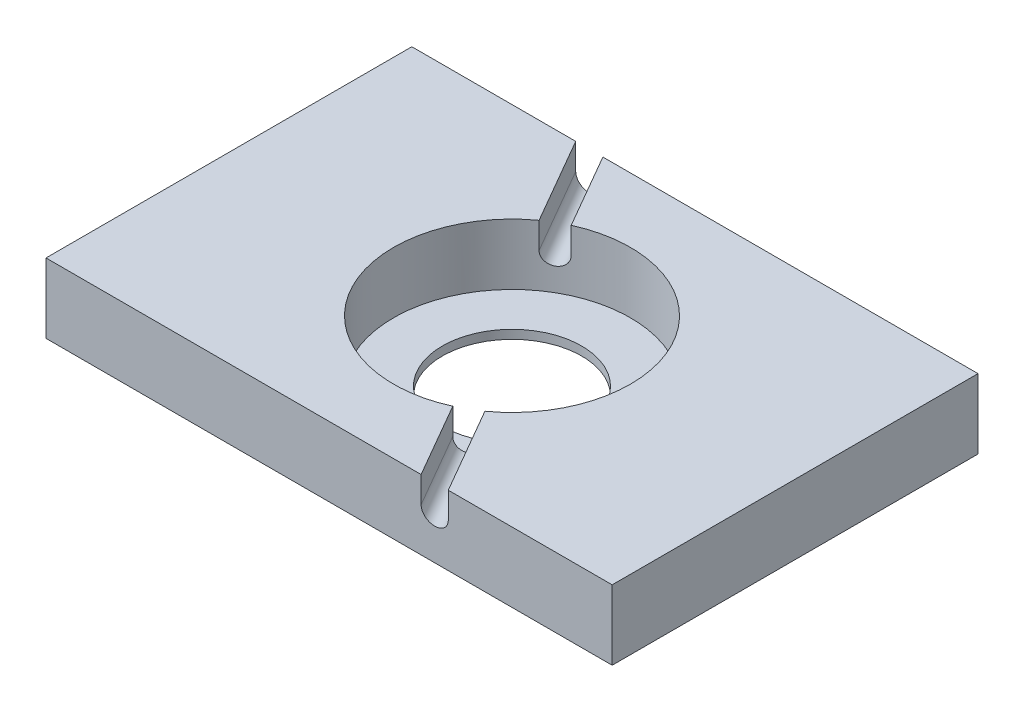
ISO-10303-21;
HEADER;
FILE_DESCRIPTION(('STEP AP214'),'2;1');
FILE_NAME('part.step','',(''),(''),'','','');
FILE_SCHEMA(('AUTOMOTIVE_DESIGN { 1 0 10303 214 1 1 1 1 }'));
ENDSEC;
DATA;
#1=APPLICATION_CONTEXT('core data for automotive mechanical design processes');
#2=APPLICATION_PROTOCOL_DEFINITION('international standard','automotive_design',2000,#1);
#3=PRODUCT_CONTEXT('',#1,'mechanical');
#4=PRODUCT('Part','Part','',(#3));
#5=PRODUCT_RELATED_PRODUCT_CATEGORY('part','',(#4));
#6=PRODUCT_DEFINITION_FORMATION('','',#4);
#7=PRODUCT_DEFINITION_CONTEXT('part definition',#1,'design');
#8=PRODUCT_DEFINITION('design','',#6,#7);
#9=PRODUCT_DEFINITION_SHAPE('','',#8);
#10=(LENGTH_UNIT() NAMED_UNIT(*) SI_UNIT(.MILLI.,.METRE.));
#11=(NAMED_UNIT(*) PLANE_ANGLE_UNIT() SI_UNIT($,.RADIAN.));
#12=(NAMED_UNIT(*) SI_UNIT($,.STERADIAN.) SOLID_ANGLE_UNIT());
#13=UNCERTAINTY_MEASURE_WITH_UNIT(LENGTH_MEASURE(1.E-05),#10,'distance_accuracy_value','');
#14=(GEOMETRIC_REPRESENTATION_CONTEXT(3) GLOBAL_UNCERTAINTY_ASSIGNED_CONTEXT((#13)) GLOBAL_UNIT_ASSIGNED_CONTEXT((#10,
#11,#12)) REPRESENTATION_CONTEXT('',''));
#15=CARTESIAN_POINT('',(0.,0.,0.));
#16=DIRECTION('',(0.,0.,1.));
#17=DIRECTION('',(1.,0.,0.));
#18=AXIS2_PLACEMENT_3D('',#15,#16,#17);
#19=CARTESIAN_POINT('',(0.,5.,0.));
#20=DIRECTION('',(-0.500000000000001,0.,-0.866025403784438));
#21=DIRECTION('',(-0.866025403784438,0.,0.500000000000001));
#22=AXIS2_PLACEMENT_3D('',#19,#20,#21);
#23=CYLINDRICAL_SURFACE('',#22,1.35);
#24=DIRECTION('',(0.500000000000001,0.,0.866025403784438));
#25=VECTOR('',#24,1.);
#26=CARTESIAN_POINT('',(-1.16913429510899,5.,0.674999999999999));
#27=LINE('',#26,#25);
#28=CARTESIAN_POINT('',(5.59728093010444,5.,12.3947749551772));
#29=VERTEX_POINT('',#28);
#30=CARTESIAN_POINT('',(10.5655099261702,5.,21.));
#31=VERTEX_POINT('',#30);
#32=EDGE_CURVE('E161',#29,#31,#27,.T.);
#33=ORIENTED_EDGE('',*,*,#32,.T.);
#34=CARTESIAN_POINT('',(12.1243556529822,5.,21.));
#35=DIRECTION('',(0.,0.,1.));
#36=DIRECTION('',(-1.,0.,0.));
#37=AXIS2_PLACEMENT_3D('',#34,#35,#36);
#38=ELLIPSE('',#37,1.55884572681199,1.35);
#39=CARTESIAN_POINT('',(13.6832013797942,5.,21.));
#40=VERTEX_POINT('',#39);
#41=EDGE_CURVE('E155',#31,#40,#38,.T.);
#42=ORIENTED_EDGE('',*,*,#41,.T.);
#43=DIRECTION('',(0.500000000000001,0.,0.866025403784438));
#44=VECTOR('',#43,1.);
#45=CARTESIAN_POINT('',(1.16913429510899,5.,-0.675000000000003));
#46=LINE('',#45,#44);
#47=CARTESIAN_POINT('',(7.93554952032243,5.,11.0447749551772));
#48=VERTEX_POINT('',#47);
#49=EDGE_CURVE('E166',#48,#40,#46,.T.);
#50=ORIENTED_EDGE('',*,*,#49,.F.);
#51=CARTESIAN_POINT('',(5.59728093010444,5.,12.3947749551772));
#52=CARTESIAN_POINT('',(5.5972842088428,4.92437060001908,12.3947740791971));
#53=CARTESIAN_POINT('',(5.6031237639697,4.84869112285636,12.3921415539073));
#54=CARTESIAN_POINT('',(5.62630433115553,4.6994302046773,12.3816337881455));
#55=CARTESIAN_POINT('',(5.64365803541745,4.62585117246974,12.3737527621441));
#56=CARTESIAN_POINT('',(5.68927809940391,4.48297429491982,12.3528434162317));
#57=CARTESIAN_POINT('',(5.71753786390667,4.41367389148562,12.3398182070514));
#58=CARTESIAN_POINT('',(5.78403534310388,4.28127269092798,12.3087885236968));
#59=CARTESIAN_POINT('',(5.82227106880656,4.21817066143053,12.29078504204));
#60=CARTESIAN_POINT('',(5.90763408490201,4.09971615500092,12.2499835902954));
#61=CARTESIAN_POINT('',(5.95478932944421,4.04438902161794,12.2271705202784));
#62=CARTESIAN_POINT('',(6.05642895992992,3.94327304825937,12.1771453932899));
#63=CARTESIAN_POINT('',(6.11091368028997,3.89748464374336,12.1499331355886));
#64=CARTESIAN_POINT('',(6.22564942698916,3.81665847126136,12.0915439376325));
#65=CARTESIAN_POINT('',(6.28591213221122,3.78164310610654,12.0603589237083));
#66=CARTESIAN_POINT('',(6.41027154239672,3.72350029374529,11.9947220385758));
#67=CARTESIAN_POINT('',(6.47436815512931,3.70037256069096,11.9602702459434));
#68=CARTESIAN_POINT('',(6.6042579519853,3.66673577968347,11.8890387425667));
#69=CARTESIAN_POINT('',(6.67004480570537,3.65618514379894,11.8522671297552));
#70=CARTESIAN_POINT('',(6.80159520826077,3.64787337634576,11.7772676801854));
#71=CARTESIAN_POINT('',(6.86735875764915,3.65011191765894,11.7390398806979));
#72=CARTESIAN_POINT('',(6.99676231827841,3.66728118794432,11.6623734707994));
#73=CARTESIAN_POINT('',(7.06040899160535,3.68216719684929,11.6239360766985));
#74=CARTESIAN_POINT('',(7.18408299433054,3.72413918165748,11.5479099452174));
#75=CARTESIAN_POINT('',(7.24411027729418,3.75122531404319,11.510321218729));
#76=CARTESIAN_POINT('',(7.35906661035923,3.81687774207047,11.4371672020162));
#77=CARTESIAN_POINT('',(7.41398665100965,3.85546383847116,11.4016055288346));
#78=CARTESIAN_POINT('',(7.51721857961073,3.94300649854494,11.3338098041633));
#79=CARTESIAN_POINT('',(7.56553027654623,3.9919633618824,11.3015758488683));
#80=CARTESIAN_POINT('',(7.65454898271001,4.09910938094687,11.2414760175652));
#81=CARTESIAN_POINT('',(7.69522230166664,4.15733743668638,11.2136295763893));
#82=CARTESIAN_POINT('',(7.7677163553256,4.28123805503431,11.1635357511352));
#83=CARTESIAN_POINT('',(7.79953707749312,4.34691062818359,11.1412883749851));
#84=CARTESIAN_POINT('',(7.85356466069944,4.48386584514771,11.1032706446075));
#85=CARTESIAN_POINT('',(7.87576953945497,4.55514964212715,11.0875016259123));
#86=CARTESIAN_POINT('',(7.91001857733231,4.70128913490527,11.063094157071));
#87=CARTESIAN_POINT('',(7.92206304137722,4.77614472344005,11.0544554929368));
#88=CARTESIAN_POINT('',(7.9356707789027,4.92696152818727,11.0446910533648));
#89=CARTESIAN_POINT('',(7.9372784850955,5.00291667573823,11.0435334287754));
#90=CARTESIAN_POINT('',(7.93009213764818,5.15407620317275,11.0486948321125));
#91=CARTESIAN_POINT('',(7.9212982224606,5.22928059303595,11.0550137605212));
#92=CARTESIAN_POINT('',(7.8935499083187,5.37664536084352,11.0748434151502));
#93=CARTESIAN_POINT('',(7.87461658290061,5.44881171862842,11.0883392246868));
#94=CARTESIAN_POINT('',(7.82705504830377,5.58823773265172,11.121962619118));
#95=CARTESIAN_POINT('',(7.7984266202044,5.65549727804998,11.1420903537648));
#96=CARTESIAN_POINT('',(7.73204458328066,5.78344843900345,11.1882581472032));
#97=CARTESIAN_POINT('',(7.69426066303117,5.84411724739578,11.2143178273689));
#98=CARTESIAN_POINT('',(7.61052701579693,5.95693352606183,11.2713103406344));
#99=CARTESIAN_POINT('',(7.56457708959774,6.00908078838793,11.3022432926185));
#100=CARTESIAN_POINT('',(7.4654587843663,6.10356122732674,11.3679578891866));
#101=CARTESIAN_POINT('',(7.41226536772892,6.14585891977978,11.4027528021536));
#102=CARTESIAN_POINT('',(7.30013470601841,6.21919539750499,11.4748625471804));
#103=CARTESIAN_POINT('',(7.24119753865789,6.2502343350806,11.5121773451443));
#104=CARTESIAN_POINT('',(7.11923748686493,6.30011205881665,11.5879937777947));
#105=CARTESIAN_POINT('',(7.05622200446263,6.31897230164712,11.6264931992786));
#106=CARTESIAN_POINT('',(6.92773230031476,6.34402729358958,11.7035094154304));
#107=CARTESIAN_POINT('',(6.86225814663795,6.35022239307548,11.7420262095881));
#108=CARTESIAN_POINT('',(6.73098545504178,6.34976635679844,11.8177642921752));
#109=CARTESIAN_POINT('',(6.66518952064379,6.34317031721471,11.8549904369866));
#110=CARTESIAN_POINT('',(6.53489253567451,6.31743474227969,11.9273104127358));
#111=CARTESIAN_POINT('',(6.47039148616018,6.29829519669009,11.9624042419331));
#112=CARTESIAN_POINT('',(6.34459316263989,6.2480311148785,12.0295979348324));
#113=CARTESIAN_POINT('',(6.28329546685998,6.21690816100673,12.061698193126));
#114=CARTESIAN_POINT('',(6.1657298592275,6.14356662489576,12.1222172969891));
#115=CARTESIAN_POINT('',(6.10946191557033,6.10134811282365,12.1506361658377));
#116=CARTESIAN_POINT('',(6.00344680927816,6.00680727485362,12.2033664278952));
#117=CARTESIAN_POINT('',(5.95372754087398,5.95444393522652,12.2276603702241));
#118=CARTESIAN_POINT('',(5.86262764784006,5.84118042679131,12.2715998238746));
#119=CARTESIAN_POINT('',(5.82124902801347,5.78027821148365,12.291244217803));
#120=CARTESIAN_POINT('',(5.74807796723432,5.6514988080572,12.3256335881739));
#121=CARTESIAN_POINT('',(5.71630985280296,5.5836044933669,12.3403661410087));
#122=CARTESIAN_POINT('',(5.66357598732342,5.44293542118101,12.3646576050891));
#123=CARTESIAN_POINT('',(5.64259804086759,5.37016627902658,12.3742223577742));
#124=CARTESIAN_POINT('',(5.61737324002635,5.24748690382159,12.3856865260372));
#125=CARTESIAN_POINT('',(5.60985027726615,5.19836120968559,12.3890924074621));
#126=CARTESIAN_POINT('',(5.59980305399651,5.09949756790951,12.3936369055325));
#127=CARTESIAN_POINT('',(5.59727877289066,5.04975962279296,12.3947755315198));
#128=CARTESIAN_POINT('',(5.59728093010444,5.,12.3947749551772));
#129=B_SPLINE_CURVE_WITH_KNOTS('',3,(#51,#52,#53,#54,#55,#56,#57,#58,#59,#60,#61,#62,#63,#64,
#65,#66,#67,#68,#69,#70,#71,#72,#73,#74,#75,#76,#77,#78,#79,#80,#81,#82,#83,#84,#85,#86,#87,#88,
#89,#90,#91,#92,#93,#94,#95,#96,#97,#98,#99,#100,#101,#102,#103,#104,#105,#106,#107,#108,#109,
#110,#111,#112,#113,#114,#115,#116,#117,#118,#119,#120,#121,#122,#123,#124,#125,#126,#127,#128),
.UNSPECIFIED.,.T.,.F.,(4,2,2,2,2,2,2,2,2,2,2,2,2,2,2,2,2,2,2,2,2,2,2,2,2,2,2,2,2,2,2,2,2,2,2,2,
2,2,4),(0.,0.226706487983184,0.45366329370987,0.68048306636914,0.907257650564309,
1.13475509888433,1.36226293058393,1.59024072181693,1.81821303087965,2.04542940789195,
2.27263997325043,2.49905047438337,2.72546387960875,2.95226940043969,3.17908147573344,
3.40687158115972,3.63466200912305,3.86249937321352,4.09032989945833,4.31718983652163,
4.54404675396134,4.77043399629381,4.99682635091236,5.22397872544765,5.45113664225729,
5.67910067902925,5.90706163188974,6.13461985476739,6.36217178229237,6.58874573608359,
6.81531987481033,7.04186410578929,7.26840690416153,7.49588544261291,7.72341859399797,
7.95152295866633,8.179368942518,8.32852886988785,8.47768818266313),.UNSPECIFIED.);
#130=EDGE_CURVE('E203',#29,#48,#129,.T.);
#131=ORIENTED_EDGE('',*,*,#130,.F.);
#132=EDGE_LOOP('',(#33,#42,#50,#131));
#133=FACE_BOUND('',#132,.T.);
#134=ADVANCED_FACE('F37',(#133),#23,.F.);
#135=DIRECTION('',(-0.500000000000001,0.,-0.866025403784438));
#136=VECTOR('',#135,1.);
#137=CARTESIAN_POINT('',(1.16913429510899,5.,-0.675000000000002));
#138=LINE('',#137,#136);
#139=CARTESIAN_POINT('',(-5.59728093010444,5.,-12.3947749551773));
#140=VERTEX_POINT('',#139);
#141=CARTESIAN_POINT('',(-10.5655099261702,5.,-21.));
#142=VERTEX_POINT('',#141);
#143=EDGE_CURVE('E45',#140,#142,#138,.T.);
#144=ORIENTED_EDGE('',*,*,#143,.T.);
#145=CARTESIAN_POINT('',(-12.1243556529822,5.,-21.));
#146=DIRECTION('',(0.,0.,-1.));
#147=DIRECTION('',(-1.,0.,0.));
#148=AXIS2_PLACEMENT_3D('',#145,#146,#147);
#149=ELLIPSE('',#148,1.55884572681199,1.35);
#150=CARTESIAN_POINT('',(-13.6832013797941,5.,-21.));
#151=VERTEX_POINT('',#150);
#152=EDGE_CURVE('E158',#142,#151,#149,.T.);
#153=ORIENTED_EDGE('',*,*,#152,.T.);
#154=DIRECTION('',(-0.500000000000001,0.,-0.866025403784438));
#155=VECTOR('',#154,1.);
#156=CARTESIAN_POINT('',(-1.16913429510899,5.,0.675000000000001));
#157=LINE('',#156,#155);
#158=CARTESIAN_POINT('',(-7.93554952032243,5.,-11.0447749551772));
#159=VERTEX_POINT('',#158);
#160=EDGE_CURVE('E12',#151,#159,#157,.F.);
#161=ORIENTED_EDGE('',*,*,#160,.T.);
#162=CARTESIAN_POINT('',(-7.93554952032243,5.,-11.0447749551772));
#163=CARTESIAN_POINT('',(-7.93554712233218,5.07562939998092,-11.0447773566579));
#164=CARTESIAN_POINT('',(-7.93034751099166,5.15130887714364,-11.0485182970997));
#165=CARTESIAN_POINT('',(-7.909657235312,5.3005697953227,-11.0633393742758));
#166=CARTESIAN_POINT('',(-7.894155214456,5.37414882753026,-11.0744276100157));
#167=CARTESIAN_POINT('',(-7.85323715772606,5.51702570508018,-11.1034810713941));
#168=CARTESIAN_POINT('',(-7.82782711343496,5.58632610851438,-11.1214421407683));
#169=CARTESIAN_POINT('',(-7.7677058797799,5.71872730907202,-11.1635158053634));
#170=CARTESIAN_POINT('',(-7.7329965444572,5.78182933856947,-11.1876271743257));
#171=CARTESIAN_POINT('',(-7.65497994268737,5.90028384499908,-11.2411529889357));
#172=CARTESIAN_POINT('',(-7.6116456222432,5.95561097838206,-11.2705840936224));
#173=CARTESIAN_POINT('',(-7.51750277620079,6.05672695174063,-11.33359403216));
#174=CARTESIAN_POINT('',(-7.46669390955711,6.10251535625664,-11.3671730552593));
#175=CARTESIAN_POINT('',(-7.35875950747093,6.18334152873864,-11.4373425276449));
#176=CARTESIAN_POINT('',(-7.30162114058417,6.21835689389346,-11.4739390543059));
#177=CARTESIAN_POINT('',(-7.18259822554134,6.27649970625472,-11.5488190201599));
#178=CARTESIAN_POINT('',(-7.12071379154949,6.29962743930905,-11.5871024187666));
#179=CARTESIAN_POINT('',(-6.99408060164752,6.33326422031653,-11.663974530848));
#180=CARTESIAN_POINT('',(-6.92934202395464,6.34381485620106,-11.7025618109989));
#181=CARTESIAN_POINT('',(-6.79861539407964,6.35212662365424,-11.778988076705));
#182=CARTESIAN_POINT('',(-6.73262737389846,6.34988808234106,-11.8168270813746));
#183=CARTESIAN_POINT('',(-6.60153053499477,6.33271881205568,-11.8905606472705));
#184=CARTESIAN_POINT('',(-6.53641943858466,6.31783280315071,-11.9264615861875));
#185=CARTESIAN_POINT('',(-6.40874187600801,6.27586081834252,-11.9955533485947));
#186=CARTESIAN_POINT('',(-6.34617544249131,6.24877468595681,-12.0287441373172));
#187=CARTESIAN_POINT('',(-6.2253440390966,6.18312225792953,-12.091722233721));
#188=CARTESIAN_POINT('',(-6.16708670639512,6.14453616152884,-12.1215035475104));
#189=CARTESIAN_POINT('',(-6.05675792226123,6.05699350145506,-12.1770071578249));
#190=CARTESIAN_POINT('',(-6.00468664964353,6.0080366381176,-12.2027293370235));
#191=CARTESIAN_POINT('',(-5.90812931589,5.90089061905313,-12.2497718823218));
#192=CARTESIAN_POINT('',(-5.86367693094834,5.84266256331362,-12.2710727892065));
#193=CARTESIAN_POINT('',(-5.78404737887614,5.71876194496569,-12.3088075686715));
#194=CARTESIAN_POINT('',(-5.74887022487884,5.65308937181641,-12.3252414343602));
#195=CARTESIAN_POINT('',(-5.6889321129744,5.51613415485229,-12.3530218287331));
#196=CARTESIAN_POINT('',(-5.66417330281383,5.44485035787285,-12.3643673084758));
#197=CARTESIAN_POINT('',(-5.62591129581653,5.29871086509473,-12.3818241109121));
#198=CARTESIAN_POINT('',(-5.6124077611991,5.22385527655994,-12.3879355906829));
#199=CARTESIAN_POINT('',(-5.5971476397133,5.07303847181273,-12.394838017282));
#200=CARTESIAN_POINT('',(-5.59534125431443,4.99708332426177,-12.3956515193921));
#201=CARTESIAN_POINT('',(-5.60340433444724,4.84592379682726,-12.3920086616108));
#202=CARTESIAN_POINT('',(-5.61327364456759,4.77071940696405,-12.387552371864));
#203=CARTESIAN_POINT('',(-5.64432078629555,4.62335463915648,-12.3734364542194));
#204=CARTESIAN_POINT('',(-5.66547516290793,4.55118828137158,-12.3637876181975));
#205=CARTESIAN_POINT('',(-5.71837464394525,4.41176226734828,-12.3394098182093));
#206=CARTESIAN_POINT('',(-5.75011998751966,4.34450272195002,-12.3246807395282));
#207=CARTESIAN_POINT('',(-5.82329348793591,4.21655156099655,-12.2902761059165));
#208=CARTESIAN_POINT('',(-5.86475379309864,4.15588275260422,-12.2705841112087));
#209=CARTESIAN_POINT('',(-5.95597758102922,4.04306647393817,-12.2265649021851));
#210=CARTESIAN_POINT('',(-6.00574126636102,3.99091921161207,-12.2022375747866));
#211=CARTESIAN_POINT('',(-6.1122109290042,3.89643877267326,-12.1492559027602));
#212=CARTESIAN_POINT('',(-6.16894091587477,3.85414108022022,-12.1205865091216));
#213=CARTESIAN_POINT('',(-6.28745511778367,3.78080460249502,-12.0595333800506));
#214=CARTESIAN_POINT('',(-6.34923926443772,3.74976566491941,-12.0271496948712));
#215=CARTESIAN_POINT('',(-6.47587824703374,3.69988794118335,-11.9594374080968));
#216=CARTESIAN_POINT('',(-6.54072746527104,3.68102769835288,-11.9241141102467));
#217=CARTESIAN_POINT('',(-6.67167031703574,3.65597270641042,-11.8513468704058));
#218=CARTESIAN_POINT('',(-6.73776391608701,3.64977760692452,-11.8139029871092));
#219=CARTESIAN_POINT('',(-6.86899136543945,3.65023364320156,-11.7380865426573));
#220=CARTESIAN_POINT('',(-6.93412811973014,3.65682968278529,-11.6997186644087));
#221=CARTESIAN_POINT('',(-7.06190754841467,3.68256525772031,-11.6230381532633));
#222=CARTESIAN_POINT('',(-7.12455022077272,3.70170480330992,-11.5847255204118));
#223=CARTESIAN_POINT('',(-7.24564082755778,3.7519688851215,-11.5093778229394));
#224=CARTESIAN_POINT('',(-7.30408931459798,3.78309183899327,-11.4723425903473));
#225=CARTESIAN_POINT('',(-7.41528319977396,3.85643337510424,-11.4007873394578));
#226=CARTESIAN_POINT('',(-7.46802863397223,3.89865188717635,-11.3662673052563));
#227=CARTESIAN_POINT('',(-7.56670193360837,3.99319272514638,-11.3008206610511));
#228=CARTESIAN_POINT('',(-7.61260073902532,4.04555606477348,-11.2699094827199));
#229=CARTESIAN_POINT('',(-7.69620336863202,4.15881957320869,-11.2129843878958));
#230=CARTESIAN_POINT('',(-7.73390522272927,4.21972178851635,-11.1869716489166));
#231=CARTESIAN_POINT('',(-7.80027282148017,4.3485011919428,-11.1407983366455));
#232=CARTESIAN_POINT('',(-7.82891564371345,4.4163955066331,-11.120652618935));
#233=CARTESIAN_POINT('',(-7.87631960144194,4.55706457881899,-11.0871294838301));
#234=CARTESIAN_POINT('',(-7.89509189347609,4.62983372097342,-11.0737444256227));
#235=CARTESIAN_POINT('',(-7.91763255484568,4.75251309617841,-11.0576311914203));
#236=CARTESIAN_POINT('',(-7.92434361606206,4.80163879031441,-11.0528190552707));
#237=CARTESIAN_POINT('',(-7.93330287847326,4.90050243209049,-11.0463901537169));
#238=CARTESIAN_POINT('',(-7.93555109805662,4.95024037720704,-11.0447733751466));
#239=CARTESIAN_POINT('',(-7.93554952032243,5.,-11.0447749551772));
#240=B_SPLINE_CURVE_WITH_KNOTS('',3,(#162,#163,#164,#165,#166,#167,#168,#169,#170,#171,#172,
#173,#174,#175,#176,#177,#178,#179,#180,#181,#182,#183,#184,#185,#186,#187,#188,#189,#190,#191,
#192,#193,#194,#195,#196,#197,#198,#199,#200,#201,#202,#203,#204,#205,#206,#207,#208,#209,#210,
#211,#212,#213,#214,#215,#216,#217,#218,#219,#220,#221,#222,#223,#224,#225,#226,#227,#228,#229,
#230,#231,#232,#233,#234,#235,#236,#237,#238,#239),.UNSPECIFIED.,.T.,.F.,(4,2,2,2,2,2,2,2,2,2,2,
2,2,2,2,2,2,2,2,2,2,2,2,2,2,2,2,2,2,2,2,2,2,2,2,2,2,2,4),(0.,0.226706487983184,0.45366329370987,
0.680483066369137,0.907257650564309,1.13475509888433,1.36226293058393,1.59024072181693,
1.81821303087966,2.04542940789195,2.27263997325042,2.49905047438337,2.72546387960875,
2.95226940043969,3.17908147573344,3.40687158115972,3.63466200912305,3.86249937321352,
4.09032989945833,4.31718983652164,4.54404675396134,4.77043399629381,4.99682635091236,
5.22397872544765,5.45113664225729,5.67910067902926,5.90706163188974,6.13461985476739,
6.36217178229237,6.58874573608359,6.81531987481033,7.04186410578929,7.26840690416154,
7.49588544261291,7.72341859399798,7.95152295866633,8.17936894251801,8.32852886988785,
8.47768818266314),.UNSPECIFIED.);
#241=EDGE_CURVE('E196',#140,#159,#240,.T.);
#242=ORIENTED_EDGE('',*,*,#241,.F.);
#243=EDGE_LOOP('',(#144,#153,#161,#242));
#244=FACE_BOUND('',#243,.T.);
#245=ADVANCED_FACE('F215',(#244),#23,.F.);
#246=CARTESIAN_POINT('',(0.,0.,0.));
#247=DIRECTION('',(0.,1.,0.));
#248=DIRECTION('',(0.,0.,1.));
#249=AXIS2_PLACEMENT_3D('',#246,#247,#248);
#250=PLANE('',#249);
#251=DIRECTION('',(-1.,0.,0.));
#252=VECTOR('',#251,1.);
#253=CARTESIAN_POINT('',(32.5,0.,-21.));
#254=LINE('',#253,#252);
#255=CARTESIAN_POINT('',(32.5,0.,-21.));
#256=VERTEX_POINT('',#255);
#257=CARTESIAN_POINT('',(-32.5,0.,-21.));
#258=VERTEX_POINT('',#257);
#259=EDGE_CURVE('E137',#256,#258,#254,.T.);
#260=ORIENTED_EDGE('',*,*,#259,.F.);
#261=DIRECTION('',(0.,0.,1.));
#262=VECTOR('',#261,1.);
#263=CARTESIAN_POINT('',(32.5,0.,-21.));
#264=LINE('',#263,#262);
#265=CARTESIAN_POINT('',(32.5,0.,21.));
#266=VERTEX_POINT('',#265);
#267=EDGE_CURVE('E144',#256,#266,#264,.T.);
#268=ORIENTED_EDGE('',*,*,#267,.T.);
#269=DIRECTION('',(1.,0.,0.));
#270=VECTOR('',#269,1.);
#271=CARTESIAN_POINT('',(32.5,0.,21.));
#272=LINE('',#271,#270);
#273=CARTESIAN_POINT('',(-32.5,0.,21.));
#274=VERTEX_POINT('',#273);
#275=EDGE_CURVE('E125',#274,#266,#272,.T.);
#276=ORIENTED_EDGE('',*,*,#275,.F.);
#277=DIRECTION('',(0.,0.,-1.));
#278=VECTOR('',#277,1.);
#279=CARTESIAN_POINT('',(-32.5,0.,-21.));
#280=LINE('',#279,#278);
#281=EDGE_CURVE('E138',#274,#258,#280,.T.);
#282=ORIENTED_EDGE('',*,*,#281,.T.);
#283=EDGE_LOOP('',(#260,#268,#276,#282));
#284=FACE_BOUND('',#283,.T.);
#285=CARTESIAN_POINT('',(0.,0.,0.));
#286=DIRECTION('',(0.,1.,0.));
#287=DIRECTION('',(0.,0.,1.));
#288=AXIS2_PLACEMENT_3D('',#285,#286,#287);
#289=CIRCLE('',#288,8.);
#290=CARTESIAN_POINT('',(0.,0.,8.));
#291=VERTEX_POINT('',#290);
#292=EDGE_CURVE('E265',#291,#291,#289,.T.);
#293=ORIENTED_EDGE('',*,*,#292,.T.);
#294=EDGE_LOOP('',(#293));
#295=FACE_BOUND('',#294,.T.);
#296=ADVANCED_FACE('F39',(#284,#295),#250,.F.);
#297=CARTESIAN_POINT('',(1.16913429510899,5.,-0.675000000000003));
#298=DIRECTION('',(-0.866025403784438,0.,0.500000000000001));
#299=DIRECTION('',(0.500000000000001,0.,0.866025403784438));
#300=AXIS2_PLACEMENT_3D('',#297,#298,#299);
#301=PLANE('',#300);
#302=DIRECTION('',(0.,1.,0.));
#303=VECTOR('',#302,1.);
#304=CARTESIAN_POINT('',(-10.5655099261702,5.,-21.));
#305=LINE('',#304,#303);
#306=CARTESIAN_POINT('',(-10.5655099261702,8.,-21.));
#307=VERTEX_POINT('',#306);
#308=EDGE_CURVE('E175',#142,#307,#305,.T.);
#309=ORIENTED_EDGE('',*,*,#308,.F.);
#310=ORIENTED_EDGE('',*,*,#143,.F.);
#311=DIRECTION('',(0.,-1.,0.));
#312=VECTOR('',#311,1.);
#313=CARTESIAN_POINT('',(-5.59728093010444,6.,-12.3947749551773));
#314=LINE('',#313,#312);
#315=CARTESIAN_POINT('',(-5.59728093010444,8.,-12.3947749551772));
#316=VERTEX_POINT('',#315);
#317=EDGE_CURVE('E178',#316,#140,#314,.T.);
#318=ORIENTED_EDGE('',*,*,#317,.F.);
#319=DIRECTION('',(0.500000000000001,0.,0.866025403784438));
#320=VECTOR('',#319,1.);
#321=CARTESIAN_POINT('',(1.16913429510899,8.,-0.675000000000003));
#322=LINE('',#321,#320);
#323=EDGE_CURVE('E172',#307,#316,#322,.T.);
#324=ORIENTED_EDGE('',*,*,#323,.F.);
#325=EDGE_LOOP('',(#309,#310,#318,#324));
#326=FACE_BOUND('',#325,.T.);
#327=ADVANCED_FACE('F217',(#326),#301,.T.);
#328=CARTESIAN_POINT('',(-1.16913429510899,5.,0.674999999999999));
#329=DIRECTION('',(0.866025403784438,0.,-0.500000000000001));
#330=DIRECTION('',(-0.500000000000001,0.,-0.866025403784438));
#331=AXIS2_PLACEMENT_3D('',#328,#329,#330);
#332=PLANE('',#331);
#333=ORIENTED_EDGE('',*,*,#160,.F.);
#334=DIRECTION('',(0.,-1.,0.));
#335=VECTOR('',#334,1.);
#336=CARTESIAN_POINT('',(-13.6832013797942,5.,-21.));
#337=LINE('',#336,#335);
#338=CARTESIAN_POINT('',(-13.6832013797942,8.,-21.));
#339=VERTEX_POINT('',#338);
#340=EDGE_CURVE('E186',#339,#151,#337,.T.);
#341=ORIENTED_EDGE('',*,*,#340,.F.);
#342=DIRECTION('',(-0.500000000000001,0.,-0.866025403784438));
#343=VECTOR('',#342,1.);
#344=CARTESIAN_POINT('',(-1.16913429510899,8.,0.674999999999999));
#345=LINE('',#344,#343);
#346=CARTESIAN_POINT('',(-7.93554952032242,8.,-11.0447749551772));
#347=VERTEX_POINT('',#346);
#348=EDGE_CURVE('E181',#347,#339,#345,.T.);
#349=ORIENTED_EDGE('',*,*,#348,.F.);
#350=DIRECTION('',(0.,-1.,0.));
#351=VECTOR('',#350,1.);
#352=CARTESIAN_POINT('',(-7.93554952032242,6.,-11.0447749551772));
#353=LINE('',#352,#351);
#354=EDGE_CURVE('E189',#159,#347,#353,.F.);
#355=ORIENTED_EDGE('',*,*,#354,.F.);
#356=EDGE_LOOP('',(#333,#341,#349,#355));
#357=FACE_BOUND('',#356,.T.);
#358=ADVANCED_FACE('F287',(#357),#332,.T.);
#359=ORIENTED_EDGE('',*,*,#49,.T.);
#360=DIRECTION('',(0.,-1.,0.));
#361=VECTOR('',#360,1.);
#362=CARTESIAN_POINT('',(13.6832013797942,5.,21.));
#363=LINE('',#362,#361);
#364=CARTESIAN_POINT('',(13.6832013797942,8.,21.));
#365=VERTEX_POINT('',#364);
#366=EDGE_CURVE('E171',#365,#40,#363,.T.);
#367=ORIENTED_EDGE('',*,*,#366,.F.);
#368=CARTESIAN_POINT('',(7.93554952032242,8.,11.0447749551772));
#369=VERTEX_POINT('',#368);
#370=EDGE_CURVE('E168',#369,#365,#322,.T.);
#371=ORIENTED_EDGE('',*,*,#370,.F.);
#372=DIRECTION('',(0.,-1.,0.));
#373=VECTOR('',#372,1.);
#374=CARTESIAN_POINT('',(7.93554952032243,6.,11.0447749551772));
#375=LINE('',#374,#373);
#376=EDGE_CURVE('E60',#48,#369,#375,.F.);
#377=ORIENTED_EDGE('',*,*,#376,.F.);
#378=EDGE_LOOP('',(#359,#367,#371,#377));
#379=FACE_BOUND('',#378,.T.);
#380=ADVANCED_FACE('F292',(#379),#301,.T.);
#381=DIRECTION('',(0.,1.,0.));
#382=VECTOR('',#381,1.);
#383=CARTESIAN_POINT('',(10.5655099261702,5.,21.));
#384=LINE('',#383,#382);
#385=CARTESIAN_POINT('',(10.5655099261702,8.,21.));
#386=VERTEX_POINT('',#385);
#387=EDGE_CURVE('E52',#31,#386,#384,.T.);
#388=ORIENTED_EDGE('',*,*,#387,.F.);
#389=ORIENTED_EDGE('',*,*,#32,.F.);
#390=DIRECTION('',(0.,-1.,0.));
#391=VECTOR('',#390,1.);
#392=CARTESIAN_POINT('',(5.59728093010444,6.,12.3947749551772));
#393=LINE('',#392,#391);
#394=CARTESIAN_POINT('',(5.59728093010444,8.,12.3947749551772));
#395=VERTEX_POINT('',#394);
#396=EDGE_CURVE('E193',#395,#29,#393,.T.);
#397=ORIENTED_EDGE('',*,*,#396,.F.);
#398=EDGE_CURVE('E187',#386,#395,#345,.T.);
#399=ORIENTED_EDGE('',*,*,#398,.F.);
#400=EDGE_LOOP('',(#388,#389,#397,#399));
#401=FACE_BOUND('',#400,.T.);
#402=ADVANCED_FACE('F294',(#401),#332,.T.);
#403=CARTESIAN_POINT('',(0.,6.,0.));
#404=DIRECTION('',(0.,-1.,0.));
#405=DIRECTION('',(0.,0.,-1.));
#406=AXIS2_PLACEMENT_3D('',#403,#404,#405);
#407=CYLINDRICAL_SURFACE('',#406,13.6);
#408=CARTESIAN_POINT('',(0.,1.,0.));
#409=DIRECTION('',(0.,1.,0.));
#410=DIRECTION('',(0.,0.,1.));
#411=AXIS2_PLACEMENT_3D('',#408,#409,#410);
#412=CIRCLE('',#411,13.6);
#413=CARTESIAN_POINT('',(0.,1.,13.6));
#414=VERTEX_POINT('',#413);
#415=EDGE_CURVE('E268',#414,#414,#412,.F.);
#416=ORIENTED_EDGE('',*,*,#415,.T.);
#417=EDGE_LOOP('',(#416));
#418=FACE_BOUND('',#417,.T.);
#419=CARTESIAN_POINT('',(0.,8.,0.));
#420=DIRECTION('',(0.,1.,0.));
#421=DIRECTION('',(0.,0.,1.));
#422=AXIS2_PLACEMENT_3D('',#419,#420,#421);
#423=CIRCLE('',#422,13.6);
#424=EDGE_CURVE('E254',#347,#395,#423,.T.);
#425=ORIENTED_EDGE('',*,*,#424,.T.);
#426=ORIENTED_EDGE('',*,*,#396,.T.);
#427=ORIENTED_EDGE('',*,*,#130,.T.);
#428=ORIENTED_EDGE('',*,*,#376,.T.);
#429=EDGE_CURVE('E249',#369,#316,#423,.T.);
#430=ORIENTED_EDGE('',*,*,#429,.T.);
#431=ORIENTED_EDGE('',*,*,#317,.T.);
#432=ORIENTED_EDGE('',*,*,#241,.T.);
#433=ORIENTED_EDGE('',*,*,#354,.T.);
#434=EDGE_LOOP('',(#425,#426,#427,#428,#430,#431,#432,#433));
#435=FACE_BOUND('',#434,.T.);
#436=ADVANCED_FACE('F207',(#418,#435),#407,.F.);
#437=CARTESIAN_POINT('',(32.5,5.,-21.));
#438=DIRECTION('',(0.,0.,-1.));
#439=DIRECTION('',(-1.,0.,0.));
#440=AXIS2_PLACEMENT_3D('',#437,#438,#439);
#441=PLANE('',#440);
#442=DIRECTION('',(0.,1.,0.));
#443=VECTOR('',#442,1.);
#444=CARTESIAN_POINT('',(32.5,5.,-21.));
#445=LINE('',#444,#443);
#446=CARTESIAN_POINT('',(32.5,8.,-21.));
#447=VERTEX_POINT('',#446);
#448=EDGE_CURVE('E147',#256,#447,#445,.T.);
#449=ORIENTED_EDGE('',*,*,#448,.F.);
#450=ORIENTED_EDGE('',*,*,#259,.T.);
#451=DIRECTION('',(0.,1.,0.));
#452=VECTOR('',#451,1.);
#453=CARTESIAN_POINT('',(-32.5,5.,-21.));
#454=LINE('',#453,#452);
#455=CARTESIAN_POINT('',(-32.5,8.,-21.));
#456=VERTEX_POINT('',#455);
#457=EDGE_CURVE('E245',#258,#456,#454,.T.);
#458=ORIENTED_EDGE('',*,*,#457,.T.);
#459=DIRECTION('',(-1.,0.,0.));
#460=VECTOR('',#459,1.);
#461=CARTESIAN_POINT('',(32.5,8.,-21.));
#462=LINE('',#461,#460);
#463=EDGE_CURVE('E257',#339,#456,#462,.T.);
#464=ORIENTED_EDGE('',*,*,#463,.F.);
#465=ORIENTED_EDGE('',*,*,#340,.T.);
#466=ORIENTED_EDGE('',*,*,#152,.F.);
#467=ORIENTED_EDGE('',*,*,#308,.T.);
#468=EDGE_CURVE('E258',#447,#307,#462,.T.);
#469=ORIENTED_EDGE('',*,*,#468,.F.);
#470=EDGE_LOOP('',(#449,#450,#458,#464,#465,#466,#467,#469));
#471=FACE_BOUND('',#470,.T.);
#472=ADVANCED_FACE('F225',(#471),#441,.T.);
#473=CARTESIAN_POINT('',(32.5,5.,21.));
#474=DIRECTION('',(0.,0.,1.));
#475=DIRECTION('',(1.,0.,0.));
#476=AXIS2_PLACEMENT_3D('',#473,#474,#475);
#477=PLANE('',#476);
#478=DIRECTION('',(0.,1.,0.));
#479=VECTOR('',#478,1.);
#480=CARTESIAN_POINT('',(-32.5,5.,21.));
#481=LINE('',#480,#479);
#482=CARTESIAN_POINT('',(-32.5,8.,21.));
#483=VERTEX_POINT('',#482);
#484=EDGE_CURVE('E132',#274,#483,#481,.T.);
#485=ORIENTED_EDGE('',*,*,#484,.F.);
#486=ORIENTED_EDGE('',*,*,#275,.T.);
#487=DIRECTION('',(0.,1.,0.));
#488=VECTOR('',#487,1.);
#489=CARTESIAN_POINT('',(32.5,5.,21.));
#490=LINE('',#489,#488);
#491=CARTESIAN_POINT('',(32.5,8.,21.));
#492=VERTEX_POINT('',#491);
#493=EDGE_CURVE('E129',#266,#492,#490,.T.);
#494=ORIENTED_EDGE('',*,*,#493,.T.);
#495=DIRECTION('',(1.,0.,0.));
#496=VECTOR('',#495,1.);
#497=CARTESIAN_POINT('',(32.5,8.,21.));
#498=LINE('',#497,#496);
#499=EDGE_CURVE('E248',#365,#492,#498,.T.);
#500=ORIENTED_EDGE('',*,*,#499,.F.);
#501=ORIENTED_EDGE('',*,*,#366,.T.);
#502=ORIENTED_EDGE('',*,*,#41,.F.);
#503=ORIENTED_EDGE('',*,*,#387,.T.);
#504=EDGE_CURVE('E251',#483,#386,#498,.T.);
#505=ORIENTED_EDGE('',*,*,#504,.F.);
#506=EDGE_LOOP('',(#485,#486,#494,#500,#501,#502,#503,#505));
#507=FACE_BOUND('',#506,.T.);
#508=ADVANCED_FACE('F127',(#507),#477,.T.);
#509=CARTESIAN_POINT('',(0.,8.,0.));
#510=DIRECTION('',(0.,1.,0.));
#511=DIRECTION('',(0.,0.,1.));
#512=AXIS2_PLACEMENT_3D('',#509,#510,#511);
#513=PLANE('',#512);
#514=ORIENTED_EDGE('',*,*,#504,.T.);
#515=ORIENTED_EDGE('',*,*,#398,.T.);
#516=ORIENTED_EDGE('',*,*,#424,.F.);
#517=ORIENTED_EDGE('',*,*,#348,.T.);
#518=ORIENTED_EDGE('',*,*,#463,.T.);
#519=DIRECTION('',(0.,0.,1.));
#520=VECTOR('',#519,1.);
#521=CARTESIAN_POINT('',(-32.5,8.,21.));
#522=LINE('',#521,#520);
#523=EDGE_CURVE('E244',#456,#483,#522,.T.);
#524=ORIENTED_EDGE('',*,*,#523,.T.);
#525=EDGE_LOOP('',(#514,#515,#516,#517,#518,#524));
#526=FACE_BOUND('',#525,.T.);
#527=ADVANCED_FACE('F219',(#526),#513,.T.);
#528=ORIENTED_EDGE('',*,*,#468,.T.);
#529=ORIENTED_EDGE('',*,*,#323,.T.);
#530=ORIENTED_EDGE('',*,*,#429,.F.);
#531=ORIENTED_EDGE('',*,*,#370,.T.);
#532=ORIENTED_EDGE('',*,*,#499,.T.);
#533=DIRECTION('',(0.,0.,-1.));
#534=VECTOR('',#533,1.);
#535=CARTESIAN_POINT('',(32.5,8.,21.));
#536=LINE('',#535,#534);
#537=EDGE_CURVE('E146',#492,#447,#536,.T.);
#538=ORIENTED_EDGE('',*,*,#537,.T.);
#539=EDGE_LOOP('',(#528,#529,#530,#531,#532,#538));
#540=FACE_BOUND('',#539,.T.);
#541=ADVANCED_FACE('F223',(#540),#513,.T.);
#542=CARTESIAN_POINT('',(0.,1.,0.));
#543=DIRECTION('',(0.,1.,0.));
#544=DIRECTION('',(0.,0.,1.));
#545=AXIS2_PLACEMENT_3D('',#542,#543,#544);
#546=PLANE('',#545);
#547=ORIENTED_EDGE('',*,*,#415,.F.);
#548=EDGE_LOOP('',(#547));
#549=FACE_BOUND('',#548,.T.);
#550=CARTESIAN_POINT('',(0.,1.,0.));
#551=DIRECTION('',(0.,1.,0.));
#552=DIRECTION('',(0.,0.,1.));
#553=AXIS2_PLACEMENT_3D('',#550,#551,#552);
#554=CIRCLE('',#553,8.);
#555=CARTESIAN_POINT('',(0.,1.,8.));
#556=VERTEX_POINT('',#555);
#557=EDGE_CURVE('E262',#556,#556,#554,.T.);
#558=ORIENTED_EDGE('',*,*,#557,.F.);
#559=EDGE_LOOP('',(#558));
#560=FACE_BOUND('',#559,.T.);
#561=ADVANCED_FACE('F239',(#549,#560),#546,.T.);
#562=CARTESIAN_POINT('',(0.,0.,0.));
#563=DIRECTION('',(0.,1.,0.));
#564=DIRECTION('',(0.,0.,1.));
#565=AXIS2_PLACEMENT_3D('',#562,#563,#564);
#566=CYLINDRICAL_SURFACE('',#565,8.);
#567=ORIENTED_EDGE('',*,*,#292,.F.);
#568=EDGE_LOOP('',(#567));
#569=FACE_BOUND('',#568,.T.);
#570=ORIENTED_EDGE('',*,*,#557,.T.);
#571=EDGE_LOOP('',(#570));
#572=FACE_BOUND('',#571,.T.);
#573=ADVANCED_FACE('F234',(#569,#572),#566,.F.);
#574=CARTESIAN_POINT('',(-32.5,5.,21.));
#575=DIRECTION('',(-1.,0.,0.));
#576=DIRECTION('',(0.,0.,1.));
#577=AXIS2_PLACEMENT_3D('',#574,#575,#576);
#578=PLANE('',#577);
#579=ORIENTED_EDGE('',*,*,#523,.F.);
#580=ORIENTED_EDGE('',*,*,#457,.F.);
#581=ORIENTED_EDGE('',*,*,#281,.F.);
#582=ORIENTED_EDGE('',*,*,#484,.T.);
#583=EDGE_LOOP('',(#579,#580,#581,#582));
#584=FACE_BOUND('',#583,.T.);
#585=ADVANCED_FACE('F231',(#584),#578,.T.);
#586=CARTESIAN_POINT('',(32.5,5.,21.));
#587=DIRECTION('',(1.,0.,0.));
#588=DIRECTION('',(0.,0.,-1.));
#589=AXIS2_PLACEMENT_3D('',#586,#587,#588);
#590=PLANE('',#589);
#591=ORIENTED_EDGE('',*,*,#537,.F.);
#592=ORIENTED_EDGE('',*,*,#493,.F.);
#593=ORIENTED_EDGE('',*,*,#267,.F.);
#594=ORIENTED_EDGE('',*,*,#448,.T.);
#595=EDGE_LOOP('',(#591,#592,#593,#594));
#596=FACE_BOUND('',#595,.T.);
#597=ADVANCED_FACE('F143',(#596),#590,.T.);
#598=CLOSED_SHELL('',(#134,#245,#296,#327,#358,#380,#402,#436,#472,#508,#527,#541,#561,#573,
#585,#597));
#599=MANIFOLD_SOLID_BREP('B2',#598);
#600=ADVANCED_BREP_SHAPE_REPRESENTATION('',(#18,#599),#14);
#601=SHAPE_DEFINITION_REPRESENTATION(#9,#600);
ENDSEC;
END-ISO-10303-21;
